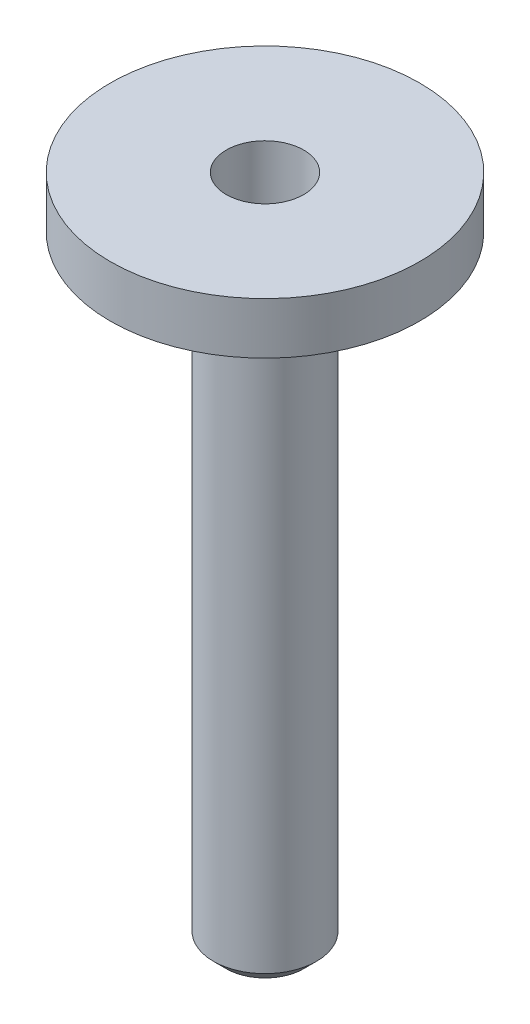
ISO-10303-21;
HEADER;
FILE_DESCRIPTION(('STEP AP214'),'2;1');
FILE_NAME('part.step','',(''),(''),'','','');
FILE_SCHEMA(('AUTOMOTIVE_DESIGN { 1 0 10303 214 1 1 1 1 }'));
ENDSEC;
DATA;
#1=APPLICATION_CONTEXT('core data for automotive mechanical design processes');
#2=APPLICATION_PROTOCOL_DEFINITION('international standard','automotive_design',2000,#1);
#3=PRODUCT_CONTEXT('',#1,'mechanical');
#4=PRODUCT('Part','Part','',(#3));
#5=PRODUCT_RELATED_PRODUCT_CATEGORY('part','',(#4));
#6=PRODUCT_DEFINITION_FORMATION('','',#4);
#7=PRODUCT_DEFINITION_CONTEXT('part definition',#1,'design');
#8=PRODUCT_DEFINITION('design','',#6,#7);
#9=PRODUCT_DEFINITION_SHAPE('','',#8);
#10=(LENGTH_UNIT() NAMED_UNIT(*) SI_UNIT(.MILLI.,.METRE.));
#11=(NAMED_UNIT(*) PLANE_ANGLE_UNIT() SI_UNIT($,.RADIAN.));
#12=(NAMED_UNIT(*) SI_UNIT($,.STERADIAN.) SOLID_ANGLE_UNIT());
#13=UNCERTAINTY_MEASURE_WITH_UNIT(LENGTH_MEASURE(1.E-05),#10,'distance_accuracy_value','');
#14=(GEOMETRIC_REPRESENTATION_CONTEXT(3) GLOBAL_UNCERTAINTY_ASSIGNED_CONTEXT((#13)) GLOBAL_UNIT_ASSIGNED_CONTEXT((#10,
#11,#12)) REPRESENTATION_CONTEXT('',''));
#15=CARTESIAN_POINT('',(0.,0.,0.));
#16=DIRECTION('',(0.,0.,1.));
#17=DIRECTION('',(1.,0.,0.));
#18=AXIS2_PLACEMENT_3D('',#15,#16,#17);
#19=CARTESIAN_POINT('',(0.,0.,0.));
#20=DIRECTION('',(0.,-1.,0.));
#21=DIRECTION('',(0.,0.,-1.));
#22=AXIS2_PLACEMENT_3D('',#19,#20,#21);
#23=PLANE('',#22);
#24=CARTESIAN_POINT('',(0.,0.,0.));
#25=DIRECTION('',(0.,1.,0.));
#26=DIRECTION('',(0.,0.,1.));
#27=AXIS2_PLACEMENT_3D('',#24,#25,#26);
#28=CIRCLE('',#27,4.7625);
#29=CARTESIAN_POINT('',(0.,0.,4.7625));
#30=VERTEX_POINT('',#29);
#31=EDGE_CURVE('E65',#30,#30,#28,.T.);
#32=ORIENTED_EDGE('',*,*,#31,.F.);
#33=EDGE_LOOP('',(#32));
#34=FACE_BOUND('',#33,.T.);
#35=CARTESIAN_POINT('',(0.,0.,0.));
#36=DIRECTION('',(0.,-1.,0.));
#37=DIRECTION('',(0.,0.,-1.));
#38=AXIS2_PLACEMENT_3D('',#35,#36,#37);
#39=CIRCLE('',#38,19.05);
#40=CARTESIAN_POINT('',(0.,0.,-19.05));
#41=VERTEX_POINT('',#40);
#42=EDGE_CURVE('E94',#41,#41,#39,.T.);
#43=ORIENTED_EDGE('',*,*,#42,.F.);
#44=EDGE_LOOP('',(#43));
#45=FACE_BOUND('',#44,.T.);
#46=ADVANCED_FACE('F41',(#34,#45),#23,.F.);
#47=CARTESIAN_POINT('',(0.,-82.55,0.));
#48=DIRECTION('',(0.,-1.,0.));
#49=DIRECTION('',(0.,0.,-1.));
#50=AXIS2_PLACEMENT_3D('',#47,#48,#49);
#51=CYLINDRICAL_SURFACE('',#50,19.05);
#52=CARTESIAN_POINT('',(0.,-6.35000000000001,0.));
#53=DIRECTION('',(0.,-1.,0.));
#54=DIRECTION('',(0.,0.,-1.));
#55=AXIS2_PLACEMENT_3D('',#52,#53,#54);
#56=CIRCLE('',#55,19.05);
#57=CARTESIAN_POINT('',(0.,-6.35000000000001,-19.05));
#58=VERTEX_POINT('',#57);
#59=EDGE_CURVE('E90',#58,#58,#56,.T.);
#60=ORIENTED_EDGE('',*,*,#59,.F.);
#61=EDGE_LOOP('',(#60));
#62=FACE_BOUND('',#61,.T.);
#63=ORIENTED_EDGE('',*,*,#42,.T.);
#64=EDGE_LOOP('',(#63));
#65=FACE_BOUND('',#64,.T.);
#66=ADVANCED_FACE('F110',(#62,#65),#51,.T.);
#67=CARTESIAN_POINT('',(-19.05,-6.35,0.));
#68=DIRECTION('',(0.,1.,0.));
#69=DIRECTION('',(0.,0.,1.));
#70=AXIS2_PLACEMENT_3D('',#67,#68,#69);
#71=PLANE('',#70);
#72=CARTESIAN_POINT('',(0.,-6.35000000000001,0.));
#73=DIRECTION('',(0.,-1.,0.));
#74=DIRECTION('',(0.,0.,-1.));
#75=AXIS2_PLACEMENT_3D('',#72,#73,#74);
#76=CIRCLE('',#75,17.4625);
#77=CARTESIAN_POINT('',(0.,-6.35000000000001,-17.4625));
#78=VERTEX_POINT('',#77);
#79=EDGE_CURVE('E86',#78,#78,#76,.T.);
#80=ORIENTED_EDGE('',*,*,#79,.F.);
#81=EDGE_LOOP('',(#80));
#82=FACE_BOUND('',#81,.T.);
#83=ORIENTED_EDGE('',*,*,#59,.T.);
#84=EDGE_LOOP('',(#83));
#85=FACE_BOUND('',#84,.T.);
#86=ADVANCED_FACE('F115',(#82,#85),#71,.F.);
#87=CARTESIAN_POINT('',(0.,-82.55,0.));
#88=DIRECTION('',(0.,-1.,0.));
#89=DIRECTION('',(0.,0.,-1.));
#90=AXIS2_PLACEMENT_3D('',#87,#88,#89);
#91=CYLINDRICAL_SURFACE('',#90,17.4625);
#92=CARTESIAN_POINT('',(0.,-3.81000000000001,0.));
#93=DIRECTION('',(0.,-1.,0.));
#94=DIRECTION('',(0.,0.,-1.));
#95=AXIS2_PLACEMENT_3D('',#92,#93,#94);
#96=CIRCLE('',#95,17.4625);
#97=CARTESIAN_POINT('',(0.,-3.81000000000001,-17.4625));
#98=VERTEX_POINT('',#97);
#99=EDGE_CURVE('E82',#98,#98,#96,.T.);
#100=ORIENTED_EDGE('',*,*,#99,.F.);
#101=EDGE_LOOP('',(#100));
#102=FACE_BOUND('',#101,.T.);
#103=ORIENTED_EDGE('',*,*,#79,.T.);
#104=EDGE_LOOP('',(#103));
#105=FACE_BOUND('',#104,.T.);
#106=ADVANCED_FACE('F123',(#102,#105),#91,.F.);
#107=CARTESIAN_POINT('',(-17.4625,-3.81,0.));
#108=DIRECTION('',(0.,1.,0.));
#109=DIRECTION('',(0.,0.,1.));
#110=AXIS2_PLACEMENT_3D('',#107,#108,#109);
#111=PLANE('',#110);
#112=CARTESIAN_POINT('',(0.,-3.81000000000001,0.));
#113=DIRECTION('',(0.,-1.,0.));
#114=DIRECTION('',(0.,0.,-1.));
#115=AXIS2_PLACEMENT_3D('',#112,#113,#114);
#116=CIRCLE('',#115,14.1605);
#117=CARTESIAN_POINT('',(0.,-3.81000000000001,-14.1605));
#118=VERTEX_POINT('',#117);
#119=EDGE_CURVE('E78',#118,#118,#116,.T.);
#120=ORIENTED_EDGE('',*,*,#119,.F.);
#121=EDGE_LOOP('',(#120));
#122=FACE_BOUND('',#121,.T.);
#123=ORIENTED_EDGE('',*,*,#99,.T.);
#124=EDGE_LOOP('',(#123));
#125=FACE_BOUND('',#124,.T.);
#126=ADVANCED_FACE('F127',(#122,#125),#111,.F.);
#127=CARTESIAN_POINT('',(0.,-82.55,0.));
#128=DIRECTION('',(0.,-1.,0.));
#129=DIRECTION('',(0.,0.,-1.));
#130=AXIS2_PLACEMENT_3D('',#127,#128,#129);
#131=CYLINDRICAL_SURFACE('',#130,14.1605);
#132=CARTESIAN_POINT('',(0.,-6.35000000000001,0.));
#133=DIRECTION('',(0.,-1.,0.));
#134=DIRECTION('',(0.,0.,-1.));
#135=AXIS2_PLACEMENT_3D('',#132,#133,#134);
#136=CIRCLE('',#135,14.1605);
#137=CARTESIAN_POINT('',(0.,-6.35000000000001,-14.1605));
#138=VERTEX_POINT('',#137);
#139=EDGE_CURVE('E70',#138,#138,#136,.T.);
#140=ORIENTED_EDGE('',*,*,#139,.F.);
#141=EDGE_LOOP('',(#140));
#142=FACE_BOUND('',#141,.T.);
#143=ORIENTED_EDGE('',*,*,#119,.T.);
#144=EDGE_LOOP('',(#143));
#145=FACE_BOUND('',#144,.T.);
#146=ADVANCED_FACE('F131',(#142,#145),#131,.T.);
#147=CARTESIAN_POINT('',(-14.1605,-6.35,0.));
#148=DIRECTION('',(0.,1.,0.));
#149=DIRECTION('',(0.,0.,1.));
#150=AXIS2_PLACEMENT_3D('',#147,#148,#149);
#151=PLANE('',#150);
#152=CARTESIAN_POINT('',(0.,-6.35000000000001,0.));
#153=DIRECTION('',(0.,-1.,0.));
#154=DIRECTION('',(0.,0.,-1.));
#155=AXIS2_PLACEMENT_3D('',#152,#153,#154);
#156=CIRCLE('',#155,6.35);
#157=CARTESIAN_POINT('',(0.,-6.35000000000001,-6.35));
#158=VERTEX_POINT('',#157);
#159=EDGE_CURVE('E64',#158,#158,#156,.T.);
#160=ORIENTED_EDGE('',*,*,#159,.F.);
#161=EDGE_LOOP('',(#160));
#162=FACE_BOUND('',#161,.T.);
#163=ORIENTED_EDGE('',*,*,#139,.T.);
#164=EDGE_LOOP('',(#163));
#165=FACE_BOUND('',#164,.T.);
#166=ADVANCED_FACE('F135',(#162,#165),#151,.F.);
#167=CARTESIAN_POINT('',(0.,-82.55,0.));
#168=DIRECTION('',(0.,-1.,0.));
#169=DIRECTION('',(0.,0.,-1.));
#170=AXIS2_PLACEMENT_3D('',#167,#168,#169);
#171=CYLINDRICAL_SURFACE('',#170,6.34999999999999);
#172=CARTESIAN_POINT('',(0.,-80.9625,0.));
#173=DIRECTION('',(0.,1.,0.));
#174=DIRECTION('',(0.,0.,1.));
#175=AXIS2_PLACEMENT_3D('',#172,#173,#174);
#176=CIRCLE('',#175,6.34999999999999);
#177=CARTESIAN_POINT('',(0.,-80.9625,6.34999999999999));
#178=VERTEX_POINT('',#177);
#179=EDGE_CURVE('E11',#178,#178,#176,.T.);
#180=ORIENTED_EDGE('',*,*,#179,.T.);
#181=EDGE_LOOP('',(#180));
#182=FACE_BOUND('',#181,.T.);
#183=ORIENTED_EDGE('',*,*,#159,.T.);
#184=EDGE_LOOP('',(#183));
#185=FACE_BOUND('',#184,.T.);
#186=ADVANCED_FACE('F139',(#182,#185),#171,.T.);
#187=CARTESIAN_POINT('',(-6.34999999999999,-82.55,0.));
#188=DIRECTION('',(0.,1.,0.));
#189=DIRECTION('',(0.,0.,1.));
#190=AXIS2_PLACEMENT_3D('',#187,#188,#189);
#191=PLANE('',#190);
#192=CARTESIAN_POINT('',(0.,-82.55,0.));
#193=DIRECTION('',(0.,1.,0.));
#194=DIRECTION('',(0.,0.,1.));
#195=AXIS2_PLACEMENT_3D('',#192,#193,#194);
#196=CIRCLE('',#195,4.76249999999999);
#197=CARTESIAN_POINT('',(0.,-82.55,4.76249999999999));
#198=VERTEX_POINT('',#197);
#199=EDGE_CURVE('E50',#198,#198,#196,.F.);
#200=ORIENTED_EDGE('',*,*,#199,.T.);
#201=EDGE_LOOP('',(#200));
#202=FACE_BOUND('',#201,.T.);
#203=ADVANCED_FACE('F57',(#202),#191,.F.);
#204=CARTESIAN_POINT('',(0.,-77.7875,0.));
#205=DIRECTION('',(0.,1.,0.));
#206=DIRECTION('',(0.,0.,1.));
#207=AXIS2_PLACEMENT_3D('',#204,#205,#206);
#208=CONICAL_SURFACE('',#207,4.76249999999998,1.02974425867665);
#209=CARTESIAN_POINT('',(0.,-80.6490986981188,0.));
#210=VERTEX_POINT('',#209);
#211=VERTEX_LOOP('',#210);
#212=FACE_BOUND('',#211,.T.);
#213=CARTESIAN_POINT('',(0.,-77.7875,0.));
#214=DIRECTION('',(0.,1.,0.));
#215=DIRECTION('',(0.,0.,1.));
#216=AXIS2_PLACEMENT_3D('',#213,#214,#215);
#217=CIRCLE('',#216,4.76249999999998);
#218=CARTESIAN_POINT('',(0.,-77.7875,4.76249999999998));
#219=VERTEX_POINT('',#218);
#220=EDGE_CURVE('E61',#219,#219,#217,.T.);
#221=ORIENTED_EDGE('',*,*,#220,.T.);
#222=EDGE_LOOP('',(#221));
#223=FACE_BOUND('',#222,.T.);
#224=ADVANCED_FACE('F53',(#212,#223),#208,.F.);
#225=CARTESIAN_POINT('',(0.,0.,0.));
#226=DIRECTION('',(0.,1.,0.));
#227=DIRECTION('',(0.,0.,1.));
#228=AXIS2_PLACEMENT_3D('',#225,#226,#227);
#229=CYLINDRICAL_SURFACE('',#228,4.76249999999999);
#230=ORIENTED_EDGE('',*,*,#220,.F.);
#231=EDGE_LOOP('',(#230));
#232=FACE_BOUND('',#231,.T.);
#233=ORIENTED_EDGE('',*,*,#31,.T.);
#234=EDGE_LOOP('',(#233));
#235=FACE_BOUND('',#234,.T.);
#236=ADVANCED_FACE('F56',(#232,#235),#229,.F.);
#237=CARTESIAN_POINT('',(0.,-82.55,0.));
#238=DIRECTION('',(0.,1.,0.));
#239=DIRECTION('',(0.,0.,1.));
#240=AXIS2_PLACEMENT_3D('',#237,#238,#239);
#241=CONICAL_SURFACE('',#240,4.76249999999999,0.785398163397444);
#242=ORIENTED_EDGE('',*,*,#179,.F.);
#243=EDGE_LOOP('',(#242));
#244=FACE_BOUND('',#243,.T.);
#245=ORIENTED_EDGE('',*,*,#199,.F.);
#246=EDGE_LOOP('',(#245));
#247=FACE_BOUND('',#246,.T.);
#248=ADVANCED_FACE('F44',(#244,#247),#241,.T.);
#249=CLOSED_SHELL('',(#46,#66,#86,#106,#126,#146,#166,#186,#203,#224,#236,#248));
#250=MANIFOLD_SOLID_BREP('B2',#249);
#251=ADVANCED_BREP_SHAPE_REPRESENTATION('',(#18,#250),#14);
#252=SHAPE_DEFINITION_REPRESENTATION(#9,#251);
ENDSEC;
END-ISO-10303-21;
